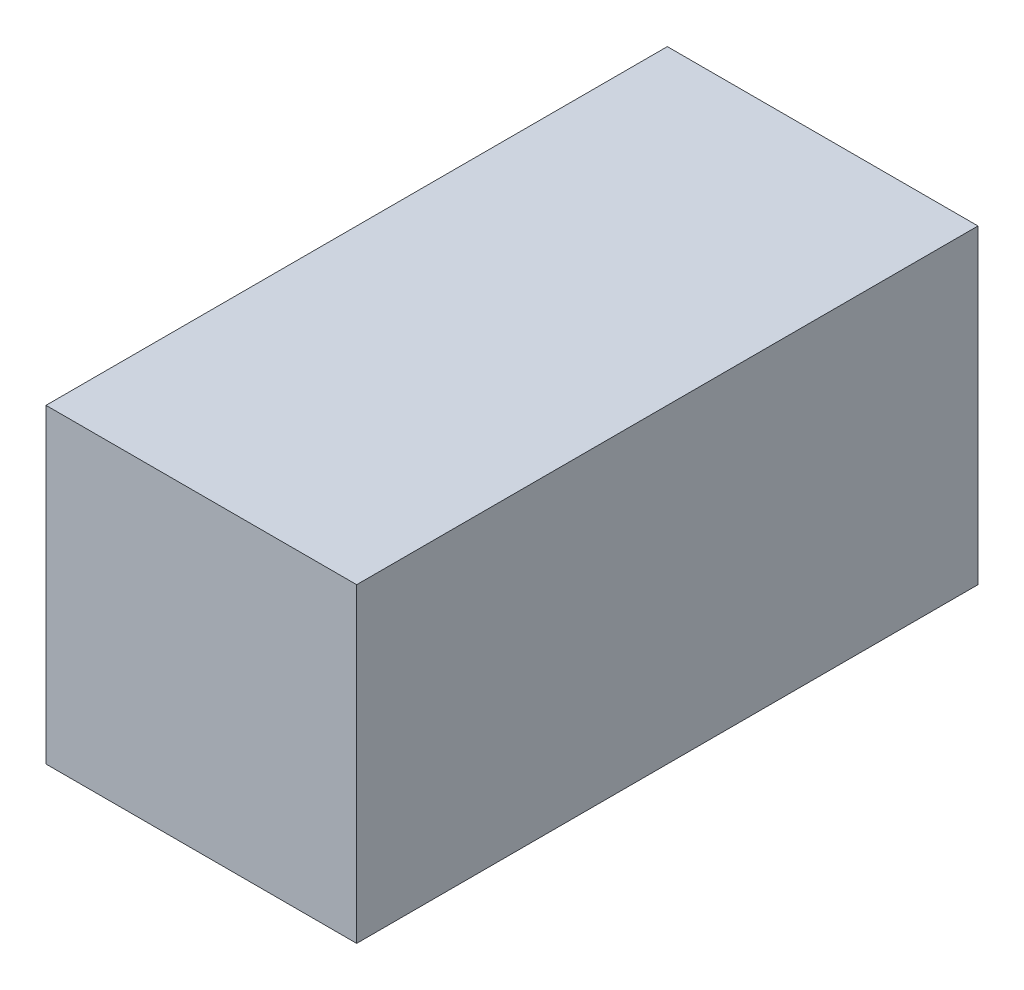
ISO-10303-21;
HEADER;
FILE_DESCRIPTION(('STEP AP214'),'2;1');
FILE_NAME('part.step','',(''),(''),'','','');
FILE_SCHEMA(('AUTOMOTIVE_DESIGN { 1 0 10303 214 1 1 1 1 }'));
ENDSEC;
DATA;
#1=APPLICATION_CONTEXT('core data for automotive mechanical design processes');
#2=APPLICATION_PROTOCOL_DEFINITION('international standard','automotive_design',2000,#1);
#3=PRODUCT_CONTEXT('',#1,'mechanical');
#4=PRODUCT('Part','Part','',(#3));
#5=PRODUCT_RELATED_PRODUCT_CATEGORY('part','',(#4));
#6=PRODUCT_DEFINITION_FORMATION('','',#4);
#7=PRODUCT_DEFINITION_CONTEXT('part definition',#1,'design');
#8=PRODUCT_DEFINITION('design','',#6,#7);
#9=PRODUCT_DEFINITION_SHAPE('','',#8);
#10=(LENGTH_UNIT() NAMED_UNIT(*) SI_UNIT(.MILLI.,.METRE.));
#11=(NAMED_UNIT(*) PLANE_ANGLE_UNIT() SI_UNIT($,.RADIAN.));
#12=(NAMED_UNIT(*) SI_UNIT($,.STERADIAN.) SOLID_ANGLE_UNIT());
#13=UNCERTAINTY_MEASURE_WITH_UNIT(LENGTH_MEASURE(1.E-05),#10,'distance_accuracy_value','');
#14=(GEOMETRIC_REPRESENTATION_CONTEXT(3) GLOBAL_UNCERTAINTY_ASSIGNED_CONTEXT((#13)) GLOBAL_UNIT_ASSIGNED_CONTEXT((#10,
#11,#12)) REPRESENTATION_CONTEXT('',''));
#15=CARTESIAN_POINT('',(0.,0.,0.));
#16=DIRECTION('',(0.,0.,1.));
#17=DIRECTION('',(1.,0.,0.));
#18=AXIS2_PLACEMENT_3D('',#15,#16,#17);
#19=CARTESIAN_POINT('',(23.3243335536544,23.3243335536544,60.));
#20=DIRECTION('',(-1.,0.,0.));
#21=DIRECTION('',(0.,-1.,0.));
#22=AXIS2_PLACEMENT_3D('',#19,#20,#21);
#23=PLANE('',#22);
#24=DIRECTION('',(0.,1.,0.));
#25=VECTOR('',#24,1.);
#26=CARTESIAN_POINT('',(23.3243335536544,23.3243335536544,0.));
#27=LINE('',#26,#25);
#28=CARTESIAN_POINT('',(23.3243335536544,-6.67566644634558,0.));
#29=VERTEX_POINT('',#28);
#30=CARTESIAN_POINT('',(23.3243335536544,23.3243335536544,0.));
#31=VERTEX_POINT('',#30);
#32=EDGE_CURVE('E96',#29,#31,#27,.T.);
#33=ORIENTED_EDGE('',*,*,#32,.T.);
#34=DIRECTION('',(0.,0.,-1.));
#35=VECTOR('',#34,1.);
#36=CARTESIAN_POINT('',(23.3243335536544,23.3243335536544,60.));
#37=LINE('',#36,#35);
#38=CARTESIAN_POINT('',(23.3243335536544,23.3243335536544,60.));
#39=VERTEX_POINT('',#38);
#40=EDGE_CURVE('E11',#39,#31,#37,.T.);
#41=ORIENTED_EDGE('',*,*,#40,.F.);
#42=DIRECTION('',(0.,1.,0.));
#43=VECTOR('',#42,1.);
#44=CARTESIAN_POINT('',(23.3243335536544,23.3243335536544,60.));
#45=LINE('',#44,#43);
#46=CARTESIAN_POINT('',(23.3243335536544,-6.67566644634558,60.));
#47=VERTEX_POINT('',#46);
#48=EDGE_CURVE('E84',#47,#39,#45,.T.);
#49=ORIENTED_EDGE('',*,*,#48,.F.);
#50=DIRECTION('',(0.,0.,-1.));
#51=VECTOR('',#50,1.);
#52=CARTESIAN_POINT('',(23.3243335536544,-6.67566644634558,60.));
#53=LINE('',#52,#51);
#54=EDGE_CURVE('E92',#47,#29,#53,.T.);
#55=ORIENTED_EDGE('',*,*,#54,.T.);
#56=EDGE_LOOP('',(#33,#41,#49,#55));
#57=FACE_BOUND('',#56,.T.);
#58=ADVANCED_FACE('F33',(#57),#23,.F.);
#59=CARTESIAN_POINT('',(23.3243335536544,23.3243335536544,60.));
#60=DIRECTION('',(0.,-1.,0.));
#61=DIRECTION('',(0.,0.,-1.));
#62=AXIS2_PLACEMENT_3D('',#59,#60,#61);
#63=PLANE('',#62);
#64=DIRECTION('',(-1.,0.,0.));
#65=VECTOR('',#64,1.);
#66=CARTESIAN_POINT('',(23.3243335536544,23.3243335536544,0.));
#67=LINE('',#66,#65);
#68=CARTESIAN_POINT('',(-6.67566644634558,23.3243335536544,0.));
#69=VERTEX_POINT('',#68);
#70=EDGE_CURVE('E88',#31,#69,#67,.T.);
#71=ORIENTED_EDGE('',*,*,#70,.T.);
#72=DIRECTION('',(0.,0.,-1.));
#73=VECTOR('',#72,1.);
#74=CARTESIAN_POINT('',(-6.67566644634558,23.3243335536544,60.));
#75=LINE('',#74,#73);
#76=CARTESIAN_POINT('',(-6.67566644634558,23.3243335536544,60.));
#77=VERTEX_POINT('',#76);
#78=EDGE_CURVE('E41',#77,#69,#75,.T.);
#79=ORIENTED_EDGE('',*,*,#78,.F.);
#80=DIRECTION('',(-1.,0.,0.));
#81=VECTOR('',#80,1.);
#82=CARTESIAN_POINT('',(23.3243335536544,23.3243335536544,60.));
#83=LINE('',#82,#81);
#84=EDGE_CURVE('E79',#39,#77,#83,.T.);
#85=ORIENTED_EDGE('',*,*,#84,.F.);
#86=ORIENTED_EDGE('',*,*,#40,.T.);
#87=EDGE_LOOP('',(#71,#79,#85,#86));
#88=FACE_BOUND('',#87,.T.);
#89=ADVANCED_FACE('F87',(#88),#63,.F.);
#90=CARTESIAN_POINT('',(-6.67566644634558,23.3243335536544,60.));
#91=DIRECTION('',(1.,0.,0.));
#92=DIRECTION('',(0.,1.,0.));
#93=AXIS2_PLACEMENT_3D('',#90,#91,#92);
#94=PLANE('',#93);
#95=DIRECTION('',(0.,-1.,0.));
#96=VECTOR('',#95,1.);
#97=CARTESIAN_POINT('',(-6.67566644634558,23.3243335536544,0.));
#98=LINE('',#97,#96);
#99=CARTESIAN_POINT('',(-6.67566644634557,-6.67566644634558,0.));
#100=VERTEX_POINT('',#99);
#101=EDGE_CURVE('E66',#69,#100,#98,.T.);
#102=ORIENTED_EDGE('',*,*,#101,.T.);
#103=DIRECTION('',(0.,0.,-1.));
#104=VECTOR('',#103,1.);
#105=CARTESIAN_POINT('',(-6.67566644634557,-6.67566644634558,60.));
#106=LINE('',#105,#104);
#107=CARTESIAN_POINT('',(-6.67566644634557,-6.67566644634558,60.));
#108=VERTEX_POINT('',#107);
#109=EDGE_CURVE('E89',#108,#100,#106,.T.);
#110=ORIENTED_EDGE('',*,*,#109,.F.);
#111=DIRECTION('',(0.,-1.,0.));
#112=VECTOR('',#111,1.);
#113=CARTESIAN_POINT('',(-6.67566644634558,23.3243335536544,60.));
#114=LINE('',#113,#112);
#115=EDGE_CURVE('E82',#77,#108,#114,.T.);
#116=ORIENTED_EDGE('',*,*,#115,.F.);
#117=ORIENTED_EDGE('',*,*,#78,.T.);
#118=EDGE_LOOP('',(#102,#110,#116,#117));
#119=FACE_BOUND('',#118,.T.);
#120=ADVANCED_FACE('F90',(#119),#94,.F.);
#121=CARTESIAN_POINT('',(23.3243335536544,-6.67566644634558,60.));
#122=DIRECTION('',(0.,1.,0.));
#123=DIRECTION('',(-1.,0.,0.));
#124=AXIS2_PLACEMENT_3D('',#121,#122,#123);
#125=PLANE('',#124);
#126=DIRECTION('',(1.,0.,0.));
#127=VECTOR('',#126,1.);
#128=CARTESIAN_POINT('',(23.3243335536544,-6.67566644634558,0.));
#129=LINE('',#128,#127);
#130=EDGE_CURVE('E72',#100,#29,#129,.T.);
#131=ORIENTED_EDGE('',*,*,#130,.T.);
#132=ORIENTED_EDGE('',*,*,#54,.F.);
#133=DIRECTION('',(1.,0.,0.));
#134=VECTOR('',#133,1.);
#135=CARTESIAN_POINT('',(23.3243335536544,-6.67566644634558,60.));
#136=LINE('',#135,#134);
#137=EDGE_CURVE('E49',#108,#47,#136,.T.);
#138=ORIENTED_EDGE('',*,*,#137,.F.);
#139=ORIENTED_EDGE('',*,*,#109,.T.);
#140=EDGE_LOOP('',(#131,#132,#138,#139));
#141=FACE_BOUND('',#140,.T.);
#142=ADVANCED_FACE('F103',(#141),#125,.F.);
#143=CARTESIAN_POINT('',(0.,0.,60.));
#144=DIRECTION('',(0.,0.,-1.));
#145=DIRECTION('',(-1.,0.,0.));
#146=AXIS2_PLACEMENT_3D('',#143,#144,#145);
#147=PLANE('',#146);
#148=ORIENTED_EDGE('',*,*,#48,.T.);
#149=ORIENTED_EDGE('',*,*,#84,.T.);
#150=ORIENTED_EDGE('',*,*,#115,.T.);
#151=ORIENTED_EDGE('',*,*,#137,.T.);
#152=EDGE_LOOP('',(#148,#149,#150,#151));
#153=FACE_BOUND('',#152,.T.);
#154=ADVANCED_FACE('F80',(#153),#147,.F.);
#155=CARTESIAN_POINT('',(0.,0.,0.));
#156=DIRECTION('',(0.,0.,-1.));
#157=DIRECTION('',(-1.,0.,0.));
#158=AXIS2_PLACEMENT_3D('',#155,#156,#157);
#159=PLANE('',#158);
#160=ORIENTED_EDGE('',*,*,#32,.F.);
#161=ORIENTED_EDGE('',*,*,#130,.F.);
#162=ORIENTED_EDGE('',*,*,#101,.F.);
#163=ORIENTED_EDGE('',*,*,#70,.F.);
#164=EDGE_LOOP('',(#160,#161,#162,#163));
#165=FACE_BOUND('',#164,.T.);
#166=ADVANCED_FACE('F106',(#165),#159,.T.);
#167=CLOSED_SHELL('',(#58,#89,#120,#142,#154,#166));
#168=MANIFOLD_SOLID_BREP('B2',#167);
#169=ADVANCED_BREP_SHAPE_REPRESENTATION('',(#18,#168),#14);
#170=SHAPE_DEFINITION_REPRESENTATION(#9,#169);
ENDSEC;
END-ISO-10303-21;
